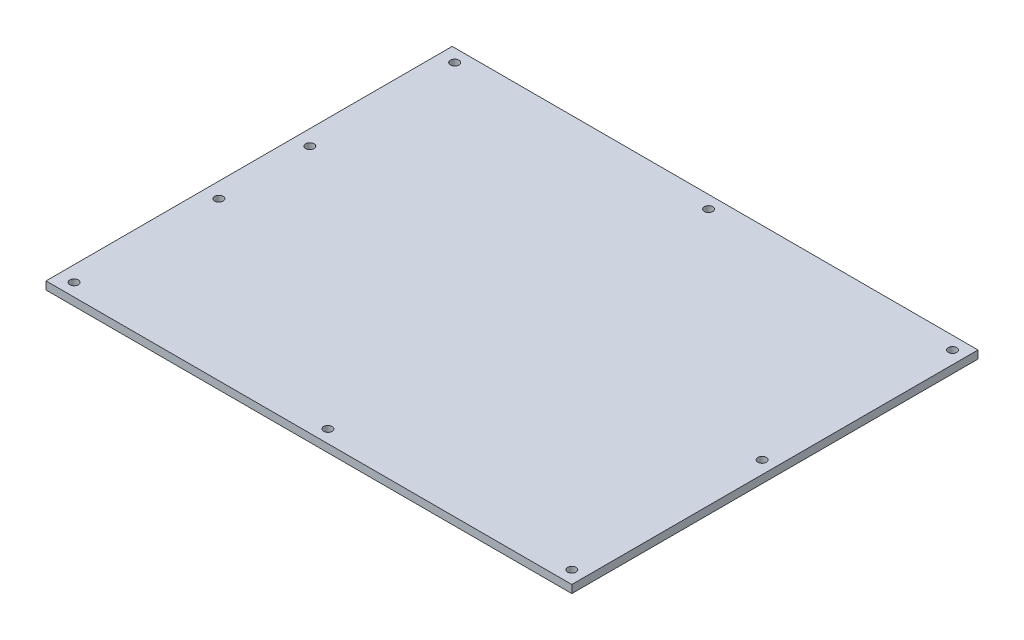
ISO-10303-21;
HEADER;
FILE_DESCRIPTION(('STEP AP214'),'2;1');
FILE_NAME('part.step','',(''),(''),'','','');
FILE_SCHEMA(('AUTOMOTIVE_DESIGN { 1 0 10303 214 1 1 1 1 }'));
ENDSEC;
DATA;
#1=APPLICATION_CONTEXT('core data for automotive mechanical design processes');
#2=APPLICATION_PROTOCOL_DEFINITION('international standard','automotive_design',2000,#1);
#3=PRODUCT_CONTEXT('',#1,'mechanical');
#4=PRODUCT('Part','Part','',(#3));
#5=PRODUCT_RELATED_PRODUCT_CATEGORY('part','',(#4));
#6=PRODUCT_DEFINITION_FORMATION('','',#4);
#7=PRODUCT_DEFINITION_CONTEXT('part definition',#1,'design');
#8=PRODUCT_DEFINITION('design','',#6,#7);
#9=PRODUCT_DEFINITION_SHAPE('','',#8);
#10=(LENGTH_UNIT() NAMED_UNIT(*) SI_UNIT(.MILLI.,.METRE.));
#11=(NAMED_UNIT(*) PLANE_ANGLE_UNIT() SI_UNIT($,.RADIAN.));
#12=(NAMED_UNIT(*) SI_UNIT($,.STERADIAN.) SOLID_ANGLE_UNIT());
#13=UNCERTAINTY_MEASURE_WITH_UNIT(LENGTH_MEASURE(1.E-05),#10,'distance_accuracy_value','');
#14=(GEOMETRIC_REPRESENTATION_CONTEXT(3) GLOBAL_UNCERTAINTY_ASSIGNED_CONTEXT((#13)) GLOBAL_UNIT_ASSIGNED_CONTEXT((#10,
#11,#12)) REPRESENTATION_CONTEXT('',''));
#15=CARTESIAN_POINT('',(0.,0.,0.));
#16=DIRECTION('',(0.,0.,1.));
#17=DIRECTION('',(1.,0.,0.));
#18=AXIS2_PLACEMENT_3D('',#15,#16,#17);
#19=CARTESIAN_POINT('',(105.5,3.175,81.5));
#20=DIRECTION('',(-1.,0.,0.));
#21=DIRECTION('',(0.,0.,1.));
#22=AXIS2_PLACEMENT_3D('',#19,#20,#21);
#23=PLANE('',#22);
#24=DIRECTION('',(0.,0.,-1.));
#25=VECTOR('',#24,1.);
#26=CARTESIAN_POINT('',(105.5,0.,81.5));
#27=LINE('',#26,#25);
#28=CARTESIAN_POINT('',(105.5,0.,81.5));
#29=VERTEX_POINT('',#28);
#30=CARTESIAN_POINT('',(105.5,0.,-81.5));
#31=VERTEX_POINT('',#30);
#32=EDGE_CURVE('E103',#29,#31,#27,.T.);
#33=ORIENTED_EDGE('',*,*,#32,.T.);
#34=DIRECTION('',(0.,-1.,0.));
#35=VECTOR('',#34,1.);
#36=CARTESIAN_POINT('',(105.5,3.175,-81.5));
#37=LINE('',#36,#35);
#38=CARTESIAN_POINT('',(105.5,3.175,-81.5));
#39=VERTEX_POINT('',#38);
#40=EDGE_CURVE('E11',#39,#31,#37,.T.);
#41=ORIENTED_EDGE('',*,*,#40,.F.);
#42=DIRECTION('',(0.,0.,-1.));
#43=VECTOR('',#42,1.);
#44=CARTESIAN_POINT('',(105.5,3.175,81.5));
#45=LINE('',#44,#43);
#46=CARTESIAN_POINT('',(105.5,3.175,81.5));
#47=VERTEX_POINT('',#46);
#48=EDGE_CURVE('E91',#47,#39,#45,.T.);
#49=ORIENTED_EDGE('',*,*,#48,.F.);
#50=DIRECTION('',(0.,-1.,0.));
#51=VECTOR('',#50,1.);
#52=CARTESIAN_POINT('',(105.5,3.175,81.5));
#53=LINE('',#52,#51);
#54=EDGE_CURVE('E99',#47,#29,#53,.T.);
#55=ORIENTED_EDGE('',*,*,#54,.T.);
#56=EDGE_LOOP('',(#33,#41,#49,#55));
#57=FACE_BOUND('',#56,.T.);
#58=ADVANCED_FACE('F40',(#57),#23,.F.);
#59=CARTESIAN_POINT('',(-105.5,3.175,-81.5));
#60=DIRECTION('',(0.,0.,1.));
#61=DIRECTION('',(1.,0.,0.));
#62=AXIS2_PLACEMENT_3D('',#59,#60,#61);
#63=PLANE('',#62);
#64=DIRECTION('',(-1.,0.,0.));
#65=VECTOR('',#64,1.);
#66=CARTESIAN_POINT('',(-105.5,0.,-81.5));
#67=LINE('',#66,#65);
#68=CARTESIAN_POINT('',(-105.5,0.,-81.5));
#69=VERTEX_POINT('',#68);
#70=EDGE_CURVE('E95',#31,#69,#67,.T.);
#71=ORIENTED_EDGE('',*,*,#70,.T.);
#72=DIRECTION('',(0.,-1.,0.));
#73=VECTOR('',#72,1.);
#74=CARTESIAN_POINT('',(-105.5,3.175,-81.5));
#75=LINE('',#74,#73);
#76=CARTESIAN_POINT('',(-105.5,3.175,-81.5));
#77=VERTEX_POINT('',#76);
#78=EDGE_CURVE('E48',#77,#69,#75,.T.);
#79=ORIENTED_EDGE('',*,*,#78,.F.);
#80=DIRECTION('',(-1.,0.,0.));
#81=VECTOR('',#80,1.);
#82=CARTESIAN_POINT('',(-105.5,3.175,-81.5));
#83=LINE('',#82,#81);
#84=EDGE_CURVE('E86',#39,#77,#83,.T.);
#85=ORIENTED_EDGE('',*,*,#84,.F.);
#86=ORIENTED_EDGE('',*,*,#40,.T.);
#87=EDGE_LOOP('',(#71,#79,#85,#86));
#88=FACE_BOUND('',#87,.T.);
#89=ADVANCED_FACE('F94',(#88),#63,.F.);
#90=CARTESIAN_POINT('',(-105.5,3.175,81.5));
#91=DIRECTION('',(1.,0.,0.));
#92=DIRECTION('',(0.,0.,-1.));
#93=AXIS2_PLACEMENT_3D('',#90,#91,#92);
#94=PLANE('',#93);
#95=DIRECTION('',(0.,0.,1.));
#96=VECTOR('',#95,1.);
#97=CARTESIAN_POINT('',(-105.5,0.,81.5));
#98=LINE('',#97,#96);
#99=CARTESIAN_POINT('',(-105.5,0.,81.5));
#100=VERTEX_POINT('',#99);
#101=EDGE_CURVE('E73',#69,#100,#98,.T.);
#102=ORIENTED_EDGE('',*,*,#101,.T.);
#103=DIRECTION('',(0.,-1.,0.));
#104=VECTOR('',#103,1.);
#105=CARTESIAN_POINT('',(-105.5,3.175,81.5));
#106=LINE('',#105,#104);
#107=CARTESIAN_POINT('',(-105.5,3.175,81.5));
#108=VERTEX_POINT('',#107);
#109=EDGE_CURVE('E96',#108,#100,#106,.T.);
#110=ORIENTED_EDGE('',*,*,#109,.F.);
#111=DIRECTION('',(0.,0.,1.));
#112=VECTOR('',#111,1.);
#113=CARTESIAN_POINT('',(-105.5,3.175,81.5));
#114=LINE('',#113,#112);
#115=EDGE_CURVE('E89',#77,#108,#114,.T.);
#116=ORIENTED_EDGE('',*,*,#115,.F.);
#117=ORIENTED_EDGE('',*,*,#78,.T.);
#118=EDGE_LOOP('',(#102,#110,#116,#117));
#119=FACE_BOUND('',#118,.T.);
#120=ADVANCED_FACE('F97',(#119),#94,.F.);
#121=CARTESIAN_POINT('',(-105.5,3.175,81.5));
#122=DIRECTION('',(0.,0.,-1.));
#123=DIRECTION('',(-1.,0.,0.));
#124=AXIS2_PLACEMENT_3D('',#121,#122,#123);
#125=PLANE('',#124);
#126=DIRECTION('',(1.,0.,0.));
#127=VECTOR('',#126,1.);
#128=CARTESIAN_POINT('',(-105.5,0.,81.5));
#129=LINE('',#128,#127);
#130=EDGE_CURVE('E79',#100,#29,#129,.T.);
#131=ORIENTED_EDGE('',*,*,#130,.T.);
#132=ORIENTED_EDGE('',*,*,#54,.F.);
#133=DIRECTION('',(1.,0.,0.));
#134=VECTOR('',#133,1.);
#135=CARTESIAN_POINT('',(-105.5,3.175,81.5));
#136=LINE('',#135,#134);
#137=EDGE_CURVE('E56',#108,#47,#136,.T.);
#138=ORIENTED_EDGE('',*,*,#137,.F.);
#139=ORIENTED_EDGE('',*,*,#109,.T.);
#140=EDGE_LOOP('',(#131,#132,#138,#139));
#141=FACE_BOUND('',#140,.T.);
#142=ADVANCED_FACE('F111',(#141),#125,.F.);
#143=CARTESIAN_POINT('',(0.,3.175,0.));
#144=DIRECTION('',(0.,-1.,0.));
#145=DIRECTION('',(0.,0.,-1.));
#146=AXIS2_PLACEMENT_3D('',#143,#144,#145);
#147=PLANE('',#146);
#148=CARTESIAN_POINT('',(2.50000000000004,3.175,76.375));
#149=DIRECTION('',(0.,-1.,0.));
#150=DIRECTION('',(0.,0.,-1.));
#151=AXIS2_PLACEMENT_3D('',#148,#149,#150);
#152=CIRCLE('',#151,1.69999999999998);
#153=CARTESIAN_POINT('',(2.50000000000004,3.175,74.675));
#154=VERTEX_POINT('',#153);
#155=EDGE_CURVE('E142',#154,#154,#152,.T.);
#156=ORIENTED_EDGE('',*,*,#155,.T.);
#157=EDGE_LOOP('',(#156));
#158=FACE_BOUND('',#157,.T.);
#159=CARTESIAN_POINT('',(100.375,3.175,76.375));
#160=DIRECTION('',(0.,-1.,0.));
#161=DIRECTION('',(0.,0.,-1.));
#162=AXIS2_PLACEMENT_3D('',#159,#160,#161);
#163=CIRCLE('',#162,1.69999999999998);
#164=CARTESIAN_POINT('',(100.375,3.175,74.675));
#165=VERTEX_POINT('',#164);
#166=EDGE_CURVE('E136',#165,#165,#163,.T.);
#167=ORIENTED_EDGE('',*,*,#166,.T.);
#168=EDGE_LOOP('',(#167));
#169=FACE_BOUND('',#168,.T.);
#170=CARTESIAN_POINT('',(100.375,3.175,0.));
#171=DIRECTION('',(0.,-1.,0.));
#172=DIRECTION('',(0.,0.,-1.));
#173=AXIS2_PLACEMENT_3D('',#170,#171,#172);
#174=CIRCLE('',#173,1.69999999999998);
#175=CARTESIAN_POINT('',(100.375,3.175,-1.69999999999999));
#176=VERTEX_POINT('',#175);
#177=EDGE_CURVE('E130',#176,#176,#174,.T.);
#178=ORIENTED_EDGE('',*,*,#177,.T.);
#179=EDGE_LOOP('',(#178));
#180=FACE_BOUND('',#179,.T.);
#181=CARTESIAN_POINT('',(100.375,3.175,-76.375));
#182=DIRECTION('',(0.,-1.,0.));
#183=DIRECTION('',(0.,0.,-1.));
#184=AXIS2_PLACEMENT_3D('',#181,#182,#183);
#185=CIRCLE('',#184,1.70000000000001);
#186=CARTESIAN_POINT('',(100.375,3.175,-78.075));
#187=VERTEX_POINT('',#186);
#188=EDGE_CURVE('E123',#187,#187,#185,.T.);
#189=ORIENTED_EDGE('',*,*,#188,.T.);
#190=EDGE_LOOP('',(#189));
#191=FACE_BOUND('',#190,.T.);
#192=CARTESIAN_POINT('',(2.5,3.175,-76.375));
#193=DIRECTION('',(0.,-1.,0.));
#194=DIRECTION('',(0.,0.,-1.));
#195=AXIS2_PLACEMENT_3D('',#192,#193,#194);
#196=CIRCLE('',#195,1.70000000000001);
#197=CARTESIAN_POINT('',(2.5,3.175,-78.075));
#198=VERTEX_POINT('',#197);
#199=EDGE_CURVE('E165',#198,#198,#196,.T.);
#200=ORIENTED_EDGE('',*,*,#199,.T.);
#201=EDGE_LOOP('',(#200));
#202=FACE_BOUND('',#201,.T.);
#203=CARTESIAN_POINT('',(-99.375,3.175,-76.375));
#204=DIRECTION('',(0.,-1.,0.));
#205=DIRECTION('',(0.,0.,-1.));
#206=AXIS2_PLACEMENT_3D('',#203,#204,#205);
#207=CIRCLE('',#206,1.70000000000001);
#208=CARTESIAN_POINT('',(-99.375,3.175,-78.075));
#209=VERTEX_POINT('',#208);
#210=EDGE_CURVE('E159',#209,#209,#207,.T.);
#211=ORIENTED_EDGE('',*,*,#210,.T.);
#212=EDGE_LOOP('',(#211));
#213=FACE_BOUND('',#212,.T.);
#214=CARTESIAN_POINT('',(-99.375,3.175,-18.25));
#215=DIRECTION('',(0.,-1.,0.));
#216=DIRECTION('',(0.,0.,-1.));
#217=AXIS2_PLACEMENT_3D('',#214,#215,#216);
#218=CIRCLE('',#217,1.69999999999998);
#219=CARTESIAN_POINT('',(-99.375,3.175,-19.95));
#220=VERTEX_POINT('',#219);
#221=EDGE_CURVE('E153',#220,#220,#218,.T.);
#222=ORIENTED_EDGE('',*,*,#221,.T.);
#223=EDGE_LOOP('',(#222));
#224=FACE_BOUND('',#223,.T.);
#225=CARTESIAN_POINT('',(-99.375,3.175,18.25));
#226=DIRECTION('',(0.,-1.,0.));
#227=DIRECTION('',(0.,0.,-1.));
#228=AXIS2_PLACEMENT_3D('',#225,#226,#227);
#229=CIRCLE('',#228,1.7);
#230=CARTESIAN_POINT('',(-99.375,3.175,16.55));
#231=VERTEX_POINT('',#230);
#232=EDGE_CURVE('E147',#231,#231,#229,.T.);
#233=ORIENTED_EDGE('',*,*,#232,.T.);
#234=EDGE_LOOP('',(#233));
#235=FACE_BOUND('',#234,.T.);
#236=CARTESIAN_POINT('',(-99.375,3.175,76.375));
#237=DIRECTION('',(0.,-1.,0.));
#238=DIRECTION('',(0.,0.,-1.));
#239=AXIS2_PLACEMENT_3D('',#236,#237,#238);
#240=CIRCLE('',#239,1.69999999999997);
#241=CARTESIAN_POINT('',(-99.375,3.175,74.675));
#242=VERTEX_POINT('',#241);
#243=EDGE_CURVE('E106',#242,#242,#240,.T.);
#244=ORIENTED_EDGE('',*,*,#243,.T.);
#245=EDGE_LOOP('',(#244));
#246=FACE_BOUND('',#245,.T.);
#247=ORIENTED_EDGE('',*,*,#48,.T.);
#248=ORIENTED_EDGE('',*,*,#84,.T.);
#249=ORIENTED_EDGE('',*,*,#115,.T.);
#250=ORIENTED_EDGE('',*,*,#137,.T.);
#251=EDGE_LOOP('',(#247,#248,#249,#250));
#252=FACE_BOUND('',#251,.T.);
#253=ADVANCED_FACE('F87',(#158,#169,#180,#191,#202,#213,#224,#235,#246,#252),#147,.F.);
#254=CARTESIAN_POINT('',(0.,0.,0.));
#255=DIRECTION('',(0.,-1.,0.));
#256=DIRECTION('',(0.,0.,-1.));
#257=AXIS2_PLACEMENT_3D('',#254,#255,#256);
#258=PLANE('',#257);
#259=CARTESIAN_POINT('',(2.50000000000004,0.,76.375));
#260=DIRECTION('',(0.,-1.,0.));
#261=DIRECTION('',(0.,0.,-1.));
#262=AXIS2_PLACEMENT_3D('',#259,#260,#261);
#263=CIRCLE('',#262,1.69999999999998);
#264=CARTESIAN_POINT('',(2.50000000000004,0.,74.675));
#265=VERTEX_POINT('',#264);
#266=EDGE_CURVE('E120',#265,#265,#263,.T.);
#267=ORIENTED_EDGE('',*,*,#266,.F.);
#268=EDGE_LOOP('',(#267));
#269=FACE_BOUND('',#268,.T.);
#270=CARTESIAN_POINT('',(100.375,0.,76.375));
#271=DIRECTION('',(0.,-1.,0.));
#272=DIRECTION('',(0.,0.,-1.));
#273=AXIS2_PLACEMENT_3D('',#270,#271,#272);
#274=CIRCLE('',#273,1.69999999999998);
#275=CARTESIAN_POINT('',(100.375,0.,74.675));
#276=VERTEX_POINT('',#275);
#277=EDGE_CURVE('E139',#276,#276,#274,.T.);
#278=ORIENTED_EDGE('',*,*,#277,.F.);
#279=EDGE_LOOP('',(#278));
#280=FACE_BOUND('',#279,.T.);
#281=CARTESIAN_POINT('',(100.375,0.,0.));
#282=DIRECTION('',(0.,-1.,0.));
#283=DIRECTION('',(0.,0.,-1.));
#284=AXIS2_PLACEMENT_3D('',#281,#282,#283);
#285=CIRCLE('',#284,1.69999999999998);
#286=CARTESIAN_POINT('',(100.375,0.,-1.69999999999999));
#287=VERTEX_POINT('',#286);
#288=EDGE_CURVE('E133',#287,#287,#285,.T.);
#289=ORIENTED_EDGE('',*,*,#288,.F.);
#290=EDGE_LOOP('',(#289));
#291=FACE_BOUND('',#290,.T.);
#292=CARTESIAN_POINT('',(100.375,0.,-76.375));
#293=DIRECTION('',(0.,-1.,0.));
#294=DIRECTION('',(0.,0.,-1.));
#295=AXIS2_PLACEMENT_3D('',#292,#293,#294);
#296=CIRCLE('',#295,1.70000000000001);
#297=CARTESIAN_POINT('',(100.375,0.,-78.075));
#298=VERTEX_POINT('',#297);
#299=EDGE_CURVE('E126',#298,#298,#296,.T.);
#300=ORIENTED_EDGE('',*,*,#299,.F.);
#301=EDGE_LOOP('',(#300));
#302=FACE_BOUND('',#301,.T.);
#303=CARTESIAN_POINT('',(2.5,0.,-76.375));
#304=DIRECTION('',(0.,-1.,0.));
#305=DIRECTION('',(0.,0.,-1.));
#306=AXIS2_PLACEMENT_3D('',#303,#304,#305);
#307=CIRCLE('',#306,1.70000000000001);
#308=CARTESIAN_POINT('',(2.5,0.,-78.075));
#309=VERTEX_POINT('',#308);
#310=EDGE_CURVE('E127',#309,#309,#307,.T.);
#311=ORIENTED_EDGE('',*,*,#310,.F.);
#312=EDGE_LOOP('',(#311));
#313=FACE_BOUND('',#312,.T.);
#314=CARTESIAN_POINT('',(-99.375,0.,-76.375));
#315=DIRECTION('',(0.,-1.,0.));
#316=DIRECTION('',(0.,0.,-1.));
#317=AXIS2_PLACEMENT_3D('',#314,#315,#316);
#318=CIRCLE('',#317,1.70000000000001);
#319=CARTESIAN_POINT('',(-99.375,0.,-78.075));
#320=VERTEX_POINT('',#319);
#321=EDGE_CURVE('E162',#320,#320,#318,.T.);
#322=ORIENTED_EDGE('',*,*,#321,.F.);
#323=EDGE_LOOP('',(#322));
#324=FACE_BOUND('',#323,.T.);
#325=CARTESIAN_POINT('',(-99.375,0.,-18.25));
#326=DIRECTION('',(0.,-1.,0.));
#327=DIRECTION('',(0.,0.,-1.));
#328=AXIS2_PLACEMENT_3D('',#325,#326,#327);
#329=CIRCLE('',#328,1.69999999999998);
#330=CARTESIAN_POINT('',(-99.375,0.,-19.95));
#331=VERTEX_POINT('',#330);
#332=EDGE_CURVE('E156',#331,#331,#329,.T.);
#333=ORIENTED_EDGE('',*,*,#332,.F.);
#334=EDGE_LOOP('',(#333));
#335=FACE_BOUND('',#334,.T.);
#336=CARTESIAN_POINT('',(-99.375,0.,18.25));
#337=DIRECTION('',(0.,-1.,0.));
#338=DIRECTION('',(0.,0.,-1.));
#339=AXIS2_PLACEMENT_3D('',#336,#337,#338);
#340=CIRCLE('',#339,1.7);
#341=CARTESIAN_POINT('',(-99.375,0.,16.55));
#342=VERTEX_POINT('',#341);
#343=EDGE_CURVE('E150',#342,#342,#340,.T.);
#344=ORIENTED_EDGE('',*,*,#343,.F.);
#345=EDGE_LOOP('',(#344));
#346=FACE_BOUND('',#345,.T.);
#347=CARTESIAN_POINT('',(-99.375,0.,76.375));
#348=DIRECTION('',(0.,-1.,0.));
#349=DIRECTION('',(0.,0.,-1.));
#350=AXIS2_PLACEMENT_3D('',#347,#348,#349);
#351=CIRCLE('',#350,1.69999999999997);
#352=CARTESIAN_POINT('',(-99.375,0.,74.675));
#353=VERTEX_POINT('',#352);
#354=EDGE_CURVE('E117',#353,#353,#351,.T.);
#355=ORIENTED_EDGE('',*,*,#354,.F.);
#356=EDGE_LOOP('',(#355));
#357=FACE_BOUND('',#356,.T.);
#358=ORIENTED_EDGE('',*,*,#32,.F.);
#359=ORIENTED_EDGE('',*,*,#130,.F.);
#360=ORIENTED_EDGE('',*,*,#101,.F.);
#361=ORIENTED_EDGE('',*,*,#70,.F.);
#362=EDGE_LOOP('',(#358,#359,#360,#361));
#363=FACE_BOUND('',#362,.T.);
#364=ADVANCED_FACE('F114',(#269,#280,#291,#302,#313,#324,#335,#346,#357,#363),#258,.T.);
#365=CARTESIAN_POINT('',(-99.375,3.175,76.375));
#366=DIRECTION('',(0.,-1.,0.));
#367=DIRECTION('',(0.,0.,-1.));
#368=AXIS2_PLACEMENT_3D('',#365,#366,#367);
#369=CYLINDRICAL_SURFACE('',#368,1.69999999999997);
#370=ORIENTED_EDGE('',*,*,#243,.F.);
#371=EDGE_LOOP('',(#370));
#372=FACE_BOUND('',#371,.T.);
#373=ORIENTED_EDGE('',*,*,#354,.T.);
#374=EDGE_LOOP('',(#373));
#375=FACE_BOUND('',#374,.T.);
#376=ADVANCED_FACE('F175',(#372,#375),#369,.F.);
#377=CARTESIAN_POINT('',(-99.375,3.175,18.25));
#378=DIRECTION('',(0.,-1.,0.));
#379=DIRECTION('',(0.,0.,-1.));
#380=AXIS2_PLACEMENT_3D('',#377,#378,#379);
#381=CYLINDRICAL_SURFACE('',#380,1.7);
#382=ORIENTED_EDGE('',*,*,#232,.F.);
#383=EDGE_LOOP('',(#382));
#384=FACE_BOUND('',#383,.T.);
#385=ORIENTED_EDGE('',*,*,#343,.T.);
#386=EDGE_LOOP('',(#385));
#387=FACE_BOUND('',#386,.T.);
#388=ADVANCED_FACE('F187',(#384,#387),#381,.F.);
#389=CARTESIAN_POINT('',(-99.375,3.175,-18.25));
#390=DIRECTION('',(0.,-1.,0.));
#391=DIRECTION('',(0.,0.,-1.));
#392=AXIS2_PLACEMENT_3D('',#389,#390,#391);
#393=CYLINDRICAL_SURFACE('',#392,1.69999999999998);
#394=ORIENTED_EDGE('',*,*,#221,.F.);
#395=EDGE_LOOP('',(#394));
#396=FACE_BOUND('',#395,.T.);
#397=ORIENTED_EDGE('',*,*,#332,.T.);
#398=EDGE_LOOP('',(#397));
#399=FACE_BOUND('',#398,.T.);
#400=ADVANCED_FACE('F193',(#396,#399),#393,.F.);
#401=CARTESIAN_POINT('',(-99.375,3.175,-76.375));
#402=DIRECTION('',(0.,-1.,0.));
#403=DIRECTION('',(0.,0.,-1.));
#404=AXIS2_PLACEMENT_3D('',#401,#402,#403);
#405=CYLINDRICAL_SURFACE('',#404,1.70000000000001);
#406=ORIENTED_EDGE('',*,*,#210,.F.);
#407=EDGE_LOOP('',(#406));
#408=FACE_BOUND('',#407,.T.);
#409=ORIENTED_EDGE('',*,*,#321,.T.);
#410=EDGE_LOOP('',(#409));
#411=FACE_BOUND('',#410,.T.);
#412=ADVANCED_FACE('F233',(#408,#411),#405,.F.);
#413=CARTESIAN_POINT('',(2.5,3.175,-76.375));
#414=DIRECTION('',(0.,-1.,0.));
#415=DIRECTION('',(0.,0.,-1.));
#416=AXIS2_PLACEMENT_3D('',#413,#414,#415);
#417=CYLINDRICAL_SURFACE('',#416,1.70000000000001);
#418=ORIENTED_EDGE('',*,*,#199,.F.);
#419=EDGE_LOOP('',(#418));
#420=FACE_BOUND('',#419,.T.);
#421=ORIENTED_EDGE('',*,*,#310,.T.);
#422=EDGE_LOOP('',(#421));
#423=FACE_BOUND('',#422,.T.);
#424=ADVANCED_FACE('F171',(#420,#423),#417,.F.);
#425=CARTESIAN_POINT('',(100.375,3.175,-76.375));
#426=DIRECTION('',(0.,-1.,0.));
#427=DIRECTION('',(0.,0.,-1.));
#428=AXIS2_PLACEMENT_3D('',#425,#426,#427);
#429=CYLINDRICAL_SURFACE('',#428,1.70000000000001);
#430=ORIENTED_EDGE('',*,*,#188,.F.);
#431=EDGE_LOOP('',(#430));
#432=FACE_BOUND('',#431,.T.);
#433=ORIENTED_EDGE('',*,*,#299,.T.);
#434=EDGE_LOOP('',(#433));
#435=FACE_BOUND('',#434,.T.);
#436=ADVANCED_FACE('F252',(#432,#435),#429,.F.);
#437=CARTESIAN_POINT('',(100.375,3.175,0.));
#438=DIRECTION('',(0.,-1.,0.));
#439=DIRECTION('',(0.,0.,-1.));
#440=AXIS2_PLACEMENT_3D('',#437,#438,#439);
#441=CYLINDRICAL_SURFACE('',#440,1.69999999999998);
#442=ORIENTED_EDGE('',*,*,#177,.F.);
#443=EDGE_LOOP('',(#442));
#444=FACE_BOUND('',#443,.T.);
#445=ORIENTED_EDGE('',*,*,#288,.T.);
#446=EDGE_LOOP('',(#445));
#447=FACE_BOUND('',#446,.T.);
#448=ADVANCED_FACE('F249',(#444,#447),#441,.F.);
#449=CARTESIAN_POINT('',(100.375,3.175,76.375));
#450=DIRECTION('',(0.,-1.,0.));
#451=DIRECTION('',(0.,0.,-1.));
#452=AXIS2_PLACEMENT_3D('',#449,#450,#451);
#453=CYLINDRICAL_SURFACE('',#452,1.69999999999998);
#454=ORIENTED_EDGE('',*,*,#166,.F.);
#455=EDGE_LOOP('',(#454));
#456=FACE_BOUND('',#455,.T.);
#457=ORIENTED_EDGE('',*,*,#277,.T.);
#458=EDGE_LOOP('',(#457));
#459=FACE_BOUND('',#458,.T.);
#460=ADVANCED_FACE('F245',(#456,#459),#453,.F.);
#461=CARTESIAN_POINT('',(2.50000000000004,3.175,76.375));
#462=DIRECTION('',(0.,-1.,0.));
#463=DIRECTION('',(0.,0.,-1.));
#464=AXIS2_PLACEMENT_3D('',#461,#462,#463);
#465=CYLINDRICAL_SURFACE('',#464,1.69999999999998);
#466=ORIENTED_EDGE('',*,*,#155,.F.);
#467=EDGE_LOOP('',(#466));
#468=FACE_BOUND('',#467,.T.);
#469=ORIENTED_EDGE('',*,*,#266,.T.);
#470=EDGE_LOOP('',(#469));
#471=FACE_BOUND('',#470,.T.);
#472=ADVANCED_FACE('F242',(#468,#471),#465,.F.);
#473=CLOSED_SHELL('',(#58,#89,#120,#142,#253,#364,#376,#388,#400,#412,#424,#436,#448,#460,#472));
#474=MANIFOLD_SOLID_BREP('B2',#473);
#475=ADVANCED_BREP_SHAPE_REPRESENTATION('',(#18,#474),#14);
#476=SHAPE_DEFINITION_REPRESENTATION(#9,#475);
ENDSEC;
END-ISO-10303-21;
